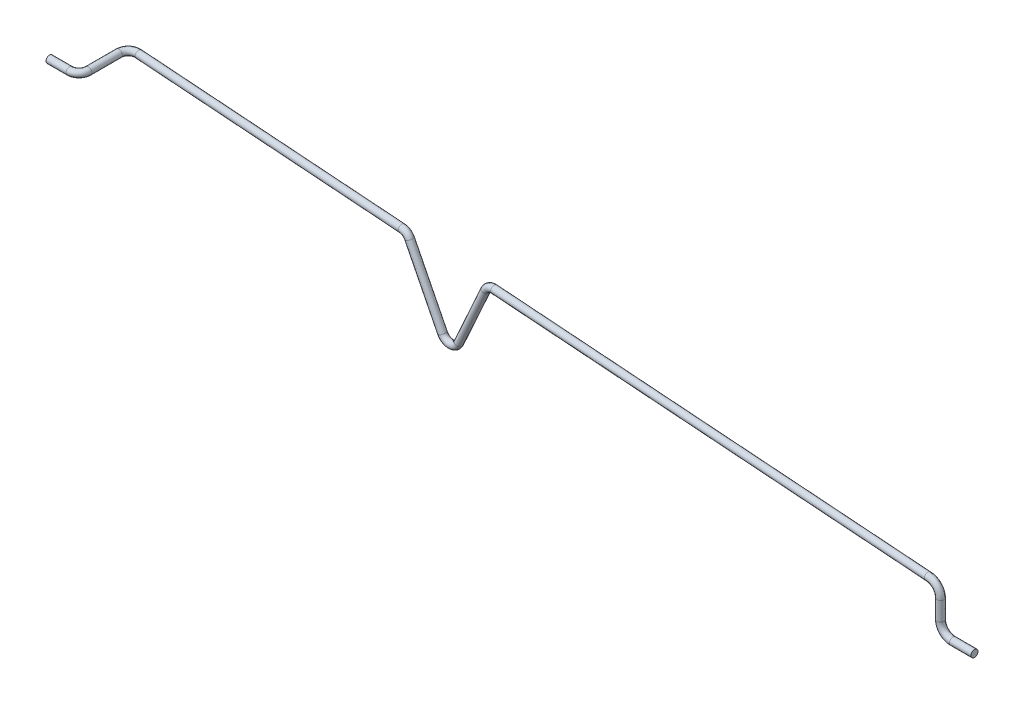
ISO-10303-21;
HEADER;
FILE_DESCRIPTION(('STEP AP214'),'2;1');
FILE_NAME('part.step','',(''),(''),'','','');
FILE_SCHEMA(('AUTOMOTIVE_DESIGN { 1 0 10303 214 1 1 1 1 }'));
ENDSEC;
DATA;
#1=APPLICATION_CONTEXT('core data for automotive mechanical design processes');
#2=APPLICATION_PROTOCOL_DEFINITION('international standard','automotive_design',2000,#1);
#3=PRODUCT_CONTEXT('',#1,'mechanical');
#4=PRODUCT('Part','Part','',(#3));
#5=PRODUCT_RELATED_PRODUCT_CATEGORY('part','',(#4));
#6=PRODUCT_DEFINITION_FORMATION('','',#4);
#7=PRODUCT_DEFINITION_CONTEXT('part definition',#1,'design');
#8=PRODUCT_DEFINITION('design','',#6,#7);
#9=PRODUCT_DEFINITION_SHAPE('','',#8);
#10=(LENGTH_UNIT() NAMED_UNIT(*) SI_UNIT(.MILLI.,.METRE.));
#11=(NAMED_UNIT(*) PLANE_ANGLE_UNIT() SI_UNIT($,.RADIAN.));
#12=(NAMED_UNIT(*) SI_UNIT($,.STERADIAN.) SOLID_ANGLE_UNIT());
#13=UNCERTAINTY_MEASURE_WITH_UNIT(LENGTH_MEASURE(1.E-05),#10,'distance_accuracy_value','');
#14=(GEOMETRIC_REPRESENTATION_CONTEXT(3) GLOBAL_UNCERTAINTY_ASSIGNED_CONTEXT((#13)) GLOBAL_UNIT_ASSIGNED_CONTEXT((#10,
#11,#12)) REPRESENTATION_CONTEXT('',''));
#15=CARTESIAN_POINT('',(0.,0.,0.));
#16=DIRECTION('',(0.,0.,1.));
#17=DIRECTION('',(1.,0.,0.));
#18=AXIS2_PLACEMENT_3D('',#15,#16,#17);
#19=CARTESIAN_POINT('',(-64.2188495074616,22.8960481279428,15.8483363673903));
#20=DIRECTION('',(1.,0.,0.));
#21=DIRECTION('',(0.,0.,-1.));
#22=AXIS2_PLACEMENT_3D('',#19,#20,#21);
#23=PLANE('',#22);
#24=CARTESIAN_POINT('',(-64.2188495074616,22.8960481279428,15.8483363673903));
#25=DIRECTION('',(1.,0.,0.));
#26=DIRECTION('',(0.,0.,-1.));
#27=AXIS2_PLACEMENT_3D('',#24,#25,#26);
#28=CIRCLE('',#27,0.375000000000001);
#29=CARTESIAN_POINT('',(-64.2188495074616,22.8960481279428,15.4733363673903));
#30=VERTEX_POINT('',#29);
#31=EDGE_CURVE('E233',#30,#30,#28,.T.);
#32=ORIENTED_EDGE('',*,*,#31,.F.);
#33=EDGE_LOOP('',(#32));
#34=FACE_BOUND('',#33,.T.);
#35=ADVANCED_FACE('F30',(#34),#23,.F.);
#36=CARTESIAN_POINT('',(31.4149506491111,14.4905385881416,13.));
#37=DIRECTION('',(1.,0.,0.));
#38=DIRECTION('',(0.,0.00337516126734805,-0.999994304126988));
#39=AXIS2_PLACEMENT_3D('',#36,#37,#38);
#40=PLANE('',#39);
#41=CARTESIAN_POINT('',(31.4149506491111,14.4905385881416,13.));
#42=DIRECTION('',(1.,0.,0.));
#43=DIRECTION('',(0.,0.00337516126734805,-0.999994304126988));
#44=AXIS2_PLACEMENT_3D('',#41,#42,#43);
#45=CIRCLE('',#44,0.375000000000001);
#46=CARTESIAN_POINT('',(31.4149506491111,14.4918042736168,12.6250021359524));
#47=VERTEX_POINT('',#46);
#48=EDGE_CURVE('E10',#47,#47,#45,.T.);
#49=ORIENTED_EDGE('',*,*,#48,.T.);
#50=EDGE_LOOP('',(#49));
#51=FACE_BOUND('',#50,.T.);
#52=ADVANCED_FACE('F127',(#51),#40,.T.);
#53=CARTESIAN_POINT('',(-59.66685028374,22.8959019788377,10.285494709423));
#54=CARTESIAN_POINT('',(-59.7419632939482,22.8959081179173,10.2735671038188));
#55=CARTESIAN_POINT('',(-59.7861856713361,22.8959117322668,10.2665215878197));
#56=CARTESIAN_POINT('',(-59.9491788533054,22.895925053902,10.2406873776312));
#57=CARTESIAN_POINT('',(-60.0620729197661,22.8959342808739,10.2336669901577));
#58=CARTESIAN_POINT('',(-60.2598447638031,22.895950445012,10.2453293695001));
#59=CARTESIAN_POINT('',(-60.3580820421677,22.8959584740666,10.2618879061166));
#60=CARTESIAN_POINT('',(-60.6439786449227,22.8959818407504,10.3425501113274));
#61=CARTESIAN_POINT('',(-60.8221902372007,22.8959964062049,10.4377969517152));
#62=CARTESIAN_POINT('',(-61.2740156605615,22.8960333344571,10.8235356976156));
#63=CARTESIAN_POINT('',(-61.45501726574,22.8960481279428,11.2145956624061));
#64=CARTESIAN_POINT('',(-61.45501726574,22.8960481279428,11.6121137336988));
#65=CARTESIAN_POINT('',(-59.6668317190504,23.0922515181698,10.2854788601156));
#66=CARTESIAN_POINT('',(-59.7419451260393,23.0922576572818,10.2735511915044));
#67=CARTESIAN_POINT('',(-59.7861665783051,23.0922612715557,10.2665058221397));
#68=CARTESIAN_POINT('',(-59.9491608616475,23.0922745932809,10.2406714376226));
#69=CARTESIAN_POINT('',(-60.0620566624428,23.0922838203945,10.2336509020387));
#70=CARTESIAN_POINT('',(-60.2598308147132,23.0922999847213,10.245313417495));
#71=CARTESIAN_POINT('',(-60.3580692396241,23.0923080138696,10.2618721473694));
#72=CARTESIAN_POINT('',(-60.643969179134,23.0923313808262,10.3425352940042));
#73=CARTESIAN_POINT('',(-60.822182851354,23.0923459464508,10.4377832460359));
#74=CARTESIAN_POINT('',(-61.2740135480564,23.0923828751335,10.8235264939696));
#75=CARTESIAN_POINT('',(-61.45501726574,23.0923976687921,11.2145910228949));
#76=CARTESIAN_POINT('',(-61.45501726574,23.0923976687921,11.6121137336988));
#77=CARTESIAN_POINT('',(-59.6948326599645,23.2709188671956,10.4619041950578));
#78=CARTESIAN_POINT('',(-59.765529332498,23.2709246453224,10.4506778838612));
#79=CARTESIAN_POINT('',(-59.8200487142283,23.270929101259,10.4420002644178));
#80=CARTESIAN_POINT('',(-59.9707831417774,23.2709414209707,10.4181064055597));
#81=CARTESIAN_POINT('',(-60.0643733360512,23.2709490702133,10.4127345499684));
#82=CARTESIAN_POINT('',(-60.2364535661927,23.270963134544,10.4228819242368));
#83=CARTESIAN_POINT('',(-60.3219292998683,23.2709701205817,10.4372894189219));
#84=CARTESIAN_POINT('',(-60.5706864140982,23.2709904518091,10.5074731748749));
#85=CARTESIAN_POINT('',(-60.7257473731661,23.2710031251335,10.5903469443642));
#86=CARTESIAN_POINT('',(-61.1188782721293,23.2710352562097,10.9259761765848));
#87=CARTESIAN_POINT('',(-61.2763668065893,23.2710481279428,11.2662353730734));
#88=CARTESIAN_POINT('',(-61.2763668065893,23.2710481279428,11.6121137336988));
#89=CARTESIAN_POINT('',(-59.756419834252,23.2709559965747,10.8497438363423));
#90=CARTESIAN_POINT('',(-59.817407103612,23.2709609811399,10.8400593343661));
#91=CARTESIAN_POINT('',(-59.8945646470963,23.2709672873216,10.8277935041633));
#92=CARTESIAN_POINT('',(-60.0183479676792,23.2709774042859,10.8081655449608));
#93=CARTESIAN_POINT('',(-60.0694982283107,23.2709815848601,10.8064180183642));
#94=CARTESIAN_POINT('',(-60.1850949520155,23.2709910327237,10.8132346248894));
#95=CARTESIAN_POINT('',(-60.2425141846665,23.2709957256688,10.8229130125867));
#96=CARTESIAN_POINT('',(-60.4096194202858,23.2710093833869,10.8700596966589));
#97=CARTESIAN_POINT('',(-60.5137832677416,23.2710178968272,10.92573103221));
#98=CARTESIAN_POINT('',(-60.7778731278621,23.2710394812195,11.1511935364873));
#99=CARTESIAN_POINT('',(-60.8836677248906,23.2710481279428,11.379766268474));
#100=CARTESIAN_POINT('',(-60.8836677248906,23.2710481279428,11.6121137336988));
#101=CARTESIAN_POINT('',(-59.7844545576776,23.0923224300603,11.0261980125646));
#102=CARTESIAN_POINT('',(-59.8410243705521,23.0923270535814,11.017214982658));
#103=CARTESIAN_POINT('',(-59.9284815269653,23.0923342015631,11.0033166355428));
#104=CARTESIAN_POINT('',(-60.0400029875627,23.0923433163506,10.9856295192288));
#105=CARTESIAN_POINT('',(-60.0718444856738,23.0923459187954,10.9855309421438));
#106=CARTESIAN_POINT('',(-60.1617430869135,23.0923532663199,10.9908321597924));
#107=CARTESIAN_POINT('',(-60.2063975419373,23.0923569159838,10.9983589606251));
#108=CARTESIAN_POINT('',(-60.3363538803235,23.0923675374764,11.0350245408887));
#109=CARTESIAN_POINT('',(-60.4173612297189,23.0923741583076,11.0783196710169));
#110=CARTESIAN_POINT('',(-60.6227416960955,23.0923909443078,11.2536599671513));
#111=CARTESIAN_POINT('',(-60.70501726574,23.0923976687921,11.4314190612556));
#112=CARTESIAN_POINT('',(-60.70501726574,23.0923976687921,11.6121137336988));
#113=CARTESIAN_POINT('',(-59.7844916870567,22.6996233513963,11.0262297111795));
#114=CARTESIAN_POINT('',(-59.8410607063701,22.6996279748524,11.0172468072868));
#115=CARTESIAN_POINT('',(-59.9285197130273,22.6996351229853,11.0033481669027));
#116=CARTESIAN_POINT('',(-60.0400389708783,22.6996442375928,10.985661399246));
#117=CARTESIAN_POINT('',(-60.0718770003203,22.6996468397542,10.985563118382));
#118=CARTESIAN_POINT('',(-60.1617709850934,22.6996541869013,10.9908640638026));
#119=CARTESIAN_POINT('',(-60.2064231470246,22.6996578363779,10.9983904781197));
#120=CARTESIAN_POINT('',(-60.336372811901,22.6996684573247,11.0350541755346));
#121=CARTESIAN_POINT('',(-60.4173760014123,22.6996750778159,11.0783470823748));
#122=CARTESIAN_POINT('',(-60.6227459211057,22.6996918629549,11.2536783744445));
#123=CARTESIAN_POINT('',(-60.70501726574,22.6996985870934,11.4314283402772));
#124=CARTESIAN_POINT('',(-60.70501726574,22.6996985870934,11.6121137336988));
#125=CARTESIAN_POINT('',(-59.7564907461426,22.5209560023704,10.8498043762373));
#126=CARTESIAN_POINT('',(-59.8174764999117,22.5209609868118,10.84012011493));
#127=CARTESIAN_POINT('',(-59.8946375771036,22.5209672932821,10.8278537246248));
#128=CARTESIAN_POINT('',(-60.018416690749,22.5209774099029,10.8082264313087));
#129=CARTESIAN_POINT('',(-60.0695603267119,22.5209815899356,10.8064794704524));
#130=CARTESIAN_POINT('',(-60.1851482336138,22.5209910370784,10.8132955570607));
#131=CARTESIAN_POINT('',(-60.2425630867806,22.5209957296658,10.822973206567));
#132=CARTESIAN_POINT('',(-60.4096555769362,22.5210093863418,10.8701162946643));
#133=CARTESIAN_POINT('',(-60.5138114795997,22.5210178991331,10.925783384047));
#134=CARTESIAN_POINT('',(-60.7778811970338,22.5210394818787,11.1512286918282));
#135=CARTESIAN_POINT('',(-60.8836677248906,22.5210481279428,11.3797839900994));
#136=CARTESIAN_POINT('',(-60.8836677248906,22.5210481279428,11.6121137336988));
#137=CARTESIAN_POINT('',(-59.6949035718551,22.5209188729913,10.4619647349527));
#138=CARTESIAN_POINT('',(-59.7655987287977,22.5209246509943,10.4507386644251));
#139=CARTESIAN_POINT('',(-59.8201216442356,22.5209291072195,10.4420604848793));
#140=CARTESIAN_POINT('',(-59.9708518648472,22.5209414265877,10.4181672919076));
#141=CARTESIAN_POINT('',(-60.0644354344523,22.5209490752888,10.4127960020566));
#142=CARTESIAN_POINT('',(-60.2365068477911,22.5209631388987,10.4229428564081));
#143=CARTESIAN_POINT('',(-60.3219782019824,22.5209701245786,10.4373496129025));
#144=CARTESIAN_POINT('',(-60.5707225707487,22.520990454764,10.5075297728799));
#145=CARTESIAN_POINT('',(-60.7257755850231,22.5210031274395,10.5903992962007));
#146=CARTESIAN_POINT('',(-61.118886341303,22.5210352568689,10.9260113319267));
#147=CARTESIAN_POINT('',(-61.2763668065893,22.5210481279428,11.2662530946981));
#148=CARTESIAN_POINT('',(-61.2763668065893,22.5210481279428,11.6121137336988));
#149=CARTESIAN_POINT('',(-59.6668688484295,22.6995524395057,10.2855105587304));
#150=CARTESIAN_POINT('',(-59.7419814618572,22.6995585785528,10.2735830161332));
#151=CARTESIAN_POINT('',(-59.7862047643672,22.6995621929779,10.2665373534997));
#152=CARTESIAN_POINT('',(-59.9491968449632,22.6995755145231,10.2407033176398));
#153=CARTESIAN_POINT('',(-60.0620891770893,22.6995847413533,10.2336830782768));
#154=CARTESIAN_POINT('',(-60.2598587128931,22.6996009053027,10.2453453215053));
#155=CARTESIAN_POINT('',(-60.3580948447114,22.6996089342637,10.2619036648638));
#156=CARTESIAN_POINT('',(-60.6439881107115,22.6996323006746,10.3425649286506));
#157=CARTESIAN_POINT('',(-60.8221976230474,22.6996468659591,10.4378106573944));
#158=CARTESIAN_POINT('',(-61.2740177730667,22.6996837937806,10.8235449012617));
#159=CARTESIAN_POINT('',(-61.45501726574,22.6996985870934,11.2146003019172));
#160=CARTESIAN_POINT('',(-61.45501726574,22.6996985870934,11.6121137336988));
#161=CARTESIAN_POINT('',(-59.66685028374,22.8959019788377,10.285494709423));
#162=CARTESIAN_POINT('',(-59.7419632939482,22.8959081179173,10.2735671038188));
#163=CARTESIAN_POINT('',(-59.7861856713361,22.8959117322668,10.2665215878197));
#164=CARTESIAN_POINT('',(-59.9491788533054,22.895925053902,10.2406873776312));
#165=CARTESIAN_POINT('',(-60.0620729197661,22.8959342808739,10.2336669901577));
#166=CARTESIAN_POINT('',(-60.2598447638031,22.895950445012,10.2453293695001));
#167=CARTESIAN_POINT('',(-60.3580820421677,22.8959584740666,10.2618879061166));
#168=CARTESIAN_POINT('',(-60.6439786449227,22.8959818407504,10.3425501113274));
#169=CARTESIAN_POINT('',(-60.8221902372007,22.8959964062049,10.4377969517152));
#170=CARTESIAN_POINT('',(-61.2740156605615,22.8960333344571,10.8235356976156));
#171=CARTESIAN_POINT('',(-61.45501726574,22.8960481279428,11.2145956624061));
#172=CARTESIAN_POINT('',(-61.45501726574,22.8960481279428,11.6121137336988));
#173=B_SPLINE_SURFACE_WITH_KNOTS('',3,3,((#53,#54,#55,#56,#57,#58,#59,#60,#61,#62,#63,#64),(#65,
#66,#67,#68,#69,#70,#71,#72,#73,#74,#75,#76),(#77,#78,#79,#80,#81,#82,#83,#84,#85,#86,#87,#88),
(#89,#90,#91,#92,#93,#94,#95,#96,#97,#98,#99,#100),(#101,#102,#103,#104,#105,#106,#107,#108,
#109,#110,#111,#112),(#113,#114,#115,#116,#117,#118,#119,#120,#121,#122,#123,#124),(#125,#126,
#127,#128,#129,#130,#131,#132,#133,#134,#135,#136),(#137,#138,#139,#140,#141,#142,#143,#144,
#145,#146,#147,#148),(#149,#150,#151,#152,#153,#154,#155,#156,#157,#158,#159,#160),(#161,#162,
#163,#164,#165,#166,#167,#168,#169,#170,#171,#172)),.UNSPECIFIED.,.T.,.F.,.F.,(4,2,2,2,4),(4,2,
2,2,2,4),(0.,0.25,0.5,0.75,1.),(-0.0229632619529378,0.,0.0249056285781138,0.0498112571562277,
0.0996225143124553,0.199245028624911),.UNSPECIFIED.);
#174=CARTESIAN_POINT('',(-59.9231868103733,22.895953578755,10.6244881938014));
#175=DIRECTION('',(-0.995488107498007,0.0217371518266946,-0.0923630015780107));
#176=DIRECTION('',(-0.0808192973258083,0.315774535423993,0.945385997335228));
#177=AXIS2_PLACEMENT_3D('',#174,#175,#176);
#178=ELLIPSE('',#177,0.375880853129422,0.375000000000001);
#179=CARTESIAN_POINT('',(-59.9535652368014,23.0146471805267,10.9798406890164));
#180=VERTEX_POINT('',#179);
#181=EDGE_CURVE('E33',#180,#180,#178,.T.);
#182=CARTESIAN_POINT('',(-61.08001726574,22.8960481279428,11.6121137336988));
#183=DIRECTION('',(0.,0.,-1.));
#184=DIRECTION('',(-1.,0.,0.));
#185=AXIS2_PLACEMENT_3D('',#182,#183,#184);
#186=CIRCLE('',#185,0.375000000000001);
#187=CARTESIAN_POINT('',(-61.45501726574,22.8960481279428,11.6121137336988));
#188=VERTEX_POINT('',#187);
#189=EDGE_CURVE('E224',#188,#188,#186,.T.);
#190=ORIENTED_EDGE('',*,*,#181,.T.);
#191=EDGE_LOOP('',(#190));
#192=FACE_BOUND('',#191,.T.);
#193=ORIENTED_EDGE('',*,*,#189,.T.);
#194=EDGE_LOOP('',(#193));
#195=FACE_BOUND('',#194,.T.);
#196=ADVANCED_FACE('F120',(#192,#195),#173,.F.);
#197=CARTESIAN_POINT('',(-61.08001726574,22.8960481279428,11.6121137336988));
#198=DIRECTION('',(0.,0.,1.));
#199=DIRECTION('',(1.,0.,0.));
#200=AXIS2_PLACEMENT_3D('',#197,#198,#199);
#201=CYLINDRICAL_SURFACE('',#200,0.375000000000001);
#202=CARTESIAN_POINT('',(-61.08001726574,22.8960481279428,14.8483363673903));
#203=DIRECTION('',(0.,0.,-1.));
#204=DIRECTION('',(-1.,0.,0.));
#205=AXIS2_PLACEMENT_3D('',#202,#203,#204);
#206=CIRCLE('',#205,0.375000000000001);
#207=CARTESIAN_POINT('',(-60.70501726574,22.8960481279428,14.8483363673903));
#208=VERTEX_POINT('',#207);
#209=EDGE_CURVE('E226',#208,#208,#206,.T.);
#210=ORIENTED_EDGE('',*,*,#209,.T.);
#211=EDGE_LOOP('',(#210));
#212=FACE_BOUND('',#211,.T.);
#213=ORIENTED_EDGE('',*,*,#189,.F.);
#214=EDGE_LOOP('',(#213));
#215=FACE_BOUND('',#214,.T.);
#216=ADVANCED_FACE('F109',(#212,#215),#201,.T.);
#217=CARTESIAN_POINT('',(-62.08001726574,22.8960481279428,14.8483363673903));
#218=DIRECTION('',(0.,-1.,0.));
#219=DIRECTION('',(0.,0.,-1.));
#220=AXIS2_PLACEMENT_3D('',#217,#218,#219);
#221=TOROIDAL_SURFACE('',#220,1.00000000000001,0.375000000000001);
#222=CARTESIAN_POINT('',(-62.08001726574,22.8960481279428,15.8483363673903));
#223=DIRECTION('',(1.,0.,0.));
#224=DIRECTION('',(0.,0.,-1.));
#225=AXIS2_PLACEMENT_3D('',#222,#223,#224);
#226=CIRCLE('',#225,0.375000000000001);
#227=CARTESIAN_POINT('',(-62.08001726574,22.8960481279428,16.2233363673903));
#228=VERTEX_POINT('',#227);
#229=EDGE_CURVE('E230',#228,#228,#226,.T.);
#230=CARTESIAN_POINT('',(-62.08001726574,22.8960481279428,14.8483363673903));
#231=DIRECTION('',(0.,-1.,0.));
#232=DIRECTION('',(0.,0.,-1.));
#233=AXIS2_PLACEMENT_3D('',#230,#231,#232);
#234=CIRCLE('',#233,1.37500000000001);
#235=EDGE_CURVE('',#208,#228,#234,.T.);
#236=ORIENTED_EDGE('',*,*,#209,.F.);
#237=ORIENTED_EDGE('',*,*,#229,.T.);
#238=ORIENTED_EDGE('',*,*,#235,.T.);
#239=ORIENTED_EDGE('',*,*,#235,.F.);
#240=EDGE_LOOP('',(#236,#238,#237,#239));
#241=FACE_BOUND('',#240,.T.);
#242=ADVANCED_FACE('F119',(#241),#221,.T.);
#243=CARTESIAN_POINT('',(-62.08001726574,22.8960481279428,15.8483363673903));
#244=DIRECTION('',(-1.,0.,0.));
#245=DIRECTION('',(0.,0.,1.));
#246=AXIS2_PLACEMENT_3D('',#243,#244,#245);
#247=CYLINDRICAL_SURFACE('',#246,0.375000000000001);
#248=ORIENTED_EDGE('',*,*,#31,.T.);
#249=EDGE_LOOP('',(#248));
#250=FACE_BOUND('',#249,.T.);
#251=ORIENTED_EDGE('',*,*,#229,.F.);
#252=EDGE_LOOP('',(#251));
#253=FACE_BOUND('',#252,.T.);
#254=ADVANCED_FACE('F88',(#250,#253),#247,.T.);
#255=CARTESIAN_POINT('',(26.6556677747406,19.1428719036104,13.0053038780196));
#256=DIRECTION('',(-0.998684950906861,0.0432917044981977,-0.027462650159852));
#257=DIRECTION('',(-0.0433080389785005,-0.999061766739092,0.));
#258=AXIS2_PLACEMENT_3D('',#255,#256,#257);
#259=CYLINDRICAL_SURFACE('',#258,0.375000000000001);
#260=CARTESIAN_POINT('',(26.4611326516824,19.152765244194,12.624814038488));
#261=CARTESIAN_POINT('',(26.4607691836794,19.1330148023952,12.6247497812131));
#262=CARTESIAN_POINT('',(26.4603805356909,19.1132608442629,12.626504011793));
#263=CARTESIAN_POINT('',(26.4595669916344,19.0743274861774,12.6334045187162));
#264=CARTESIAN_POINT('',(26.4591420184419,19.0551494316947,12.6385581765406));
#265=CARTESIAN_POINT('',(26.4582728467392,19.0179883676209,12.6518537983054));
#266=CARTESIAN_POINT('',(26.4578287703566,18.9999992207451,12.6599787216062));
#267=CARTESIAN_POINT('',(26.4569317301739,18.9654742875904,12.6788133911895));
#268=CARTESIAN_POINT('',(26.4564787681213,18.9489382189655,12.689522633794));
#269=CARTESIAN_POINT('',(26.4550211473983,18.8984775829741,12.7276607176761));
#270=CARTESIAN_POINT('',(26.4540129111647,18.8677563683137,12.759627459868));
#271=CARTESIAN_POINT('',(26.4525526837515,18.8297274947308,12.8145599529353));
#272=CARTESIAN_POINT('',(26.4520607410307,18.8181847013693,12.8347613782733));
#273=CARTESIAN_POINT('',(26.4511234819598,18.7989687173499,12.8769569987221));
#274=CARTESIAN_POINT('',(26.4506781111512,18.7912909661073,12.8989490451943));
#275=CARTESIAN_POINT('',(26.4498881313585,18.7808752574254,12.9422356731663));
#276=CARTESIAN_POINT('',(26.449538325614,18.7777929811835,12.9634466096379));
#277=CARTESIAN_POINT('',(26.4489140791441,18.7758528664935,13.0060543679817));
#278=CARTESIAN_POINT('',(26.4486395715797,18.7769912683964,13.0274510074906));
#279=CARTESIAN_POINT('',(26.4482023496195,18.7829000745747,13.0670012085214));
#280=CARTESIAN_POINT('',(26.4480299887026,18.7872021587518,13.0852276807053));
#281=CARTESIAN_POINT('',(26.4477483760824,18.7985589457747,13.1207879300875));
#282=CARTESIAN_POINT('',(26.447639166309,18.805615472264,13.1381211072343));
#283=CARTESIAN_POINT('',(26.4473921432408,18.8317714290636,13.1909447840266));
#284=CARTESIAN_POINT('',(26.4473664933114,18.8553760986522,13.2243318233828));
#285=CARTESIAN_POINT('',(26.447536000939,18.8987087775704,13.2699398603377));
#286=CARTESIAN_POINT('',(26.4476393770768,18.9156073217927,13.2850269484565));
#287=CARTESIAN_POINT('',(26.4479294332928,18.9517050121617,13.3122424288723));
#288=CARTESIAN_POINT('',(26.448116179385,18.9709059725787,13.3243684647544));
#289=CARTESIAN_POINT('',(26.4485748750963,19.0113638979059,13.3451975791983));
#290=CARTESIAN_POINT('',(26.4488477564891,19.0326414999516,13.3538607576084));
#291=CARTESIAN_POINT('',(26.449475087118,19.0764536854633,13.3669601114042));
#292=CARTESIAN_POINT('',(26.4498293993908,19.0989861106861,13.3714033209125));
#293=CARTESIAN_POINT('',(26.450565297101,19.1417770024293,13.3752775664378));
#294=CARTESIAN_POINT('',(26.4509386353234,19.1619874228505,13.3752415738531));
#295=CARTESIAN_POINT('',(26.4517297959981,19.2020621904103,13.371486392923));
#296=CARTESIAN_POINT('',(26.4521476374202,19.2219263857375,13.367765628278));
#297=CARTESIAN_POINT('',(26.4529821048118,19.2593920525525,13.3573896823117));
#298=CARTESIAN_POINT('',(26.4533968473082,19.2770552625955,13.3509533429433));
#299=CARTESIAN_POINT('',(26.4542396970355,19.3112184163353,13.3355591481779));
#300=CARTESIAN_POINT('',(26.4546678066151,19.327718153914,13.3266008473922));
#301=CARTESIAN_POINT('',(26.4560705114827,19.3791745961469,13.2937691504496));
#302=CARTESIAN_POINT('',(26.4570578988224,19.4113610313541,13.2652691570633));
#303=CARTESIAN_POINT('',(26.4585245991298,19.4531936346731,13.2149488012459));
#304=CARTESIAN_POINT('',(26.4590314556965,19.4664457119685,13.1959506904479));
#305=CARTESIAN_POINT('',(26.4600089618796,19.4894415853906,13.155889902934));
#306=CARTESIAN_POINT('',(26.4604796196366,19.4991861721116,13.1348276928331));
#307=CARTESIAN_POINT('',(26.4613456144605,19.5141920879575,13.0921684601659));
#308=CARTESIAN_POINT('',(26.4617433211896,19.5196282964833,13.0706334539364));
#309=CARTESIAN_POINT('',(26.4624673267403,19.5261532638337,13.026926724413));
#310=CARTESIAN_POINT('',(26.4627937524446,19.5272498079973,13.0047562132776));
#311=CARTESIAN_POINT('',(26.4633210683673,19.5250885346828,12.9636884086415));
#312=CARTESIAN_POINT('',(26.4635330271129,19.5224063301488,12.9447585584884));
#313=CARTESIAN_POINT('',(26.4638912866307,19.513991110222,12.9075777901196));
#314=CARTESIAN_POINT('',(26.4640374525191,19.5082518796142,12.8893283363809));
#315=CARTESIAN_POINT('',(26.4643817922188,19.4866397559041,12.8355277449585));
#316=CARTESIAN_POINT('',(26.4644771831989,19.4664267698536,12.8016214530489));
#317=CARTESIAN_POINT('',(26.4644269568177,19.4281485176355,12.754128152221));
#318=CARTESIAN_POINT('',(26.464367635101,19.4129259545166,12.7380899388836));
#319=CARTESIAN_POINT('',(26.4641691261612,19.380085485446,12.7085966947131));
#320=CARTESIAN_POINT('',(26.4640298469623,19.3624648387945,12.695144662619));
#321=CARTESIAN_POINT('',(26.4636633480013,19.3243366640788,12.6707518938343));
#322=CARTESIAN_POINT('',(26.4634321931799,19.3037306090286,12.6599644725216));
#323=CARTESIAN_POINT('',(26.4628847551225,19.2609172882656,12.6424146374638));
#324=CARTESIAN_POINT('',(26.4625687274964,19.2387149746478,12.635640330743));
#325=CARTESIAN_POINT('',(26.4618848802988,19.1952170600356,12.6270529076298));
#326=CARTESIAN_POINT('',(26.4615233101126,19.1739931831717,12.6248831027411));
#327=CARTESIAN_POINT('',(26.4611326516824,19.152765244194,12.624814038488));
#328=B_SPLINE_CURVE_WITH_KNOTS('',3,(#260,#261,#262,#263,#264,#265,#266,#267,#268,#269,#270,
#271,#272,#273,#274,#275,#276,#277,#278,#279,#280,#281,#282,#283,#284,#285,#286,#287,#288,#289,
#290,#291,#292,#293,#294,#295,#296,#297,#298,#299,#300,#301,#302,#303,#304,#305,#306,#307,#308,
#309,#310,#311,#312,#313,#314,#315,#316,#317,#318,#319,#320,#321,#322,#323,#324,#325,#326,#327),
.UNSPECIFIED.,.T.,.F.,(4,2,2,2,2,2,2,2,2,2,2,2,2,2,2,2,2,2,2,2,2,2,2,2,2,2,2,2,2,2,2,2,2,4),(0.,
0.05918459036512,0.118498118465079,0.177476677140948,0.236443750301533,0.36684682644776,
0.436375472166972,0.50582188361996,0.569744868280976,0.633610926019884,0.68955028758337,
0.745526748110397,0.866033728001825,0.933765622540419,1.00155124394909,1.07009683377417,
1.13852796572137,1.19882542892012,1.25914869777079,1.315333244057,1.37152771899149,
1.49811450420513,1.56735966269204,1.63658920341442,1.70283965041427,1.7689711903798,
1.82604847692585,1.88324225226625,1.99963945470717,2.06576606492012,2.13196889408505,
2.20138039184734,2.27058514411813,2.33419723368511),.UNSPECIFIED.);
#329=CARTESIAN_POINT('',(26.461132651683,19.152765244194,12.624814038488));
#330=VERTEX_POINT('',#329);
#331=EDGE_CURVE('E65',#330,#330,#328,.T.);
#332=ORIENTED_EDGE('',*,*,#331,.T.);
#333=EDGE_LOOP('',(#332));
#334=FACE_BOUND('',#333,.T.);
#335=CARTESIAN_POINT('',(-21.026499778463,21.2098323656384,11.6941008953492));
#336=DIRECTION('',(0.998684950906861,-0.0432917044981977,0.027462650159852));
#337=DIRECTION('',(0.0276064476766096,0.00272714377870501,-0.999615149311718));
#338=AXIS2_PLACEMENT_3D('',#335,#336,#337);
#339=CIRCLE('',#338,0.375000000000001);
#340=CARTESIAN_POINT('',(-21.0104190881783,21.5844432454198,11.6998541682792));
#341=VERTEX_POINT('',#340);
#342=EDGE_CURVE('E47',#341,#341,#339,.T.);
#343=ORIENTED_EDGE('',*,*,#342,.T.);
#344=EDGE_LOOP('',(#343));
#345=FACE_BOUND('',#344,.T.);
#346=ADVANCED_FACE('F83',(#334,#345),#259,.T.);
#347=CARTESIAN_POINT('',(-21.0693816192223,20.2108700195548,11.6787588342026));
#348=DIRECTION('',(-0.0280983374109124,-0.014144236592073,0.999505089534801));
#349=DIRECTION('',(0.999605084747423,0.,0.0281011485013743));
#350=AXIS2_PLACEMENT_3D('',#347,#348,#349);
#351=TOROIDAL_SURFACE('',#350,1.,0.375000000000001);
#352=CARTESIAN_POINT('',(-21.9748546219661,20.6348277183897,11.6593034775928));
#353=DIRECTION('',(0.423472696566027,0.905571537853241,0.0247197308483585));
#354=DIRECTION('',(0.0384442729111264,0.00929831270203577,-0.999217483464551));
#355=AXIS2_PLACEMENT_3D('',#352,#353,#354);
#356=CIRCLE('',#355,0.375000000000001);
#357=CARTESIAN_POINT('',(-22.314406997995,20.7938118554527,11.6520077188641));
#358=VERTEX_POINT('',#357);
#359=EDGE_CURVE('E50',#358,#358,#356,.T.);
#360=CARTESIAN_POINT('',(-21.0693816192223,20.2108700195548,11.6787588342026));
#361=DIRECTION('',(-0.0280983374109124,-0.014144236592073,0.999505089534801));
#362=DIRECTION('',(0.999605084747423,0.,0.0281011485013743));
#363=AXIS2_PLACEMENT_3D('',#360,#361,#362);
#364=CIRCLE('',#363,1.375);
#365=EDGE_CURVE('',#341,#358,#364,.T.);
#366=ORIENTED_EDGE('',*,*,#342,.F.);
#367=ORIENTED_EDGE('',*,*,#359,.T.);
#368=ORIENTED_EDGE('',*,*,#365,.T.);
#369=ORIENTED_EDGE('',*,*,#365,.F.);
#370=EDGE_LOOP('',(#366,#368,#367,#369));
#371=FACE_BOUND('',#370,.T.);
#372=ADVANCED_FACE('F87',(#371),#351,.T.);
#373=CARTESIAN_POINT('',(-21.9748546219661,20.6348277183897,11.6593034775928));
#374=DIRECTION('',(-0.423472696566024,-0.905571537853241,-0.0247197308483568));
#375=DIRECTION('',(0.905848346298783,-0.423602140584488,0.));
#376=AXIS2_PLACEMENT_3D('',#373,#374,#375);
#377=CYLINDRICAL_SURFACE('',#376,0.375000000000001);
#378=CARTESIAN_POINT('',(-24.9942013941655,14.178131638607,11.4830525878616));
#379=DIRECTION('',(0.423472696566025,0.905571537853242,0.0247197308483568));
#380=DIRECTION('',(0.0384442729111257,0.0092983127020343,-0.999217483464551));
#381=AXIS2_PLACEMENT_3D('',#378,#379,#380);
#382=CIRCLE('',#381,0.375000000000001);
#383=CARTESIAN_POINT('',(-24.6546490181366,14.019147501544,11.4903483465903));
#384=VERTEX_POINT('',#383);
#385=EDGE_CURVE('E53',#384,#384,#382,.T.);
#386=ORIENTED_EDGE('',*,*,#385,.T.);
#387=EDGE_LOOP('',(#386));
#388=FACE_BOUND('',#387,.T.);
#389=ORIENTED_EDGE('',*,*,#359,.F.);
#390=EDGE_LOOP('',(#389));
#391=FACE_BOUND('',#390,.T.);
#392=ADVANCED_FACE('F193',(#388,#391),#377,.T.);
#393=CARTESIAN_POINT('',(-25.8996743969093,14.6020893374419,11.4635972312518));
#394=DIRECTION('',(0.0280983374109124,0.0141442365920712,-0.999505089534801));
#395=DIRECTION('',(-0.999605084747423,0.,-0.0281011485013743));
#396=AXIS2_PLACEMENT_3D('',#393,#394,#395);
#397=TOROIDAL_SURFACE('',#396,0.999999999999998,0.375000000000001);
#398=CARTESIAN_POINT('',(-26.7924474176492,14.1526822197359,11.4321397044254));
#399=DIRECTION('',(0.449629644122343,-0.893215082231831,-1.9541182720097E-13));
#400=DIRECTION('',(0.0178938678969091,0.00900747604322991,-0.999799317296736));
#401=AXIS2_PLACEMENT_3D('',#398,#399,#400);
#402=CIRCLE('',#401,0.375000000000001);
#403=CARTESIAN_POINT('',(-27.1272373004267,13.9841545505961,11.4203431318655));
#404=VERTEX_POINT('',#403);
#405=EDGE_CURVE('E56',#404,#404,#402,.T.);
#406=CARTESIAN_POINT('',(-25.8996743969093,14.6020893374419,11.4635972312518));
#407=DIRECTION('',(0.0280983374109124,0.0141442365920712,-0.999505089534801));
#408=DIRECTION('',(-0.999605084747423,0.,-0.0281011485013743));
#409=AXIS2_PLACEMENT_3D('',#406,#407,#408);
#410=CIRCLE('',#409,1.375);
#411=EDGE_CURVE('',#384,#404,#410,.T.);
#412=ORIENTED_EDGE('',*,*,#385,.F.);
#413=ORIENTED_EDGE('',*,*,#405,.T.);
#414=ORIENTED_EDGE('',*,*,#411,.T.);
#415=ORIENTED_EDGE('',*,*,#411,.F.);
#416=EDGE_LOOP('',(#412,#414,#413,#415));
#417=FACE_BOUND('',#416,.T.);
#418=ADVANCED_FACE('F198',(#417),#397,.T.);
#419=CARTESIAN_POINT('',(-26.7924474176492,14.1526822197359,11.4321397044254));
#420=DIRECTION('',(-0.449629644122344,0.893215082231829,1.94523058664612E-13));
#421=DIRECTION('',(-0.89321508223183,-0.449629644122344,0.));
#422=AXIS2_PLACEMENT_3D('',#419,#420,#421);
#423=CYLINDRICAL_SURFACE('',#422,0.375000000000001);
#424=CARTESIAN_POINT('',(-30.2889237075634,21.0986329541753,11.4321397044269));
#425=DIRECTION('',(0.449629644122344,-0.89321508223183,-1.94519302736331E-13));
#426=DIRECTION('',(0.0178938678969095,0.00900747604322914,-0.999799317296736));
#427=AXIS2_PLACEMENT_3D('',#424,#425,#426);
#428=CIRCLE('',#427,0.375000000000001);
#429=CARTESIAN_POINT('',(-29.9541338247859,21.2671606233151,11.4439362769868));
#430=VERTEX_POINT('',#429);
#431=EDGE_CURVE('E59',#430,#430,#428,.T.);
#432=ORIENTED_EDGE('',*,*,#431,.T.);
#433=EDGE_LOOP('',(#432));
#434=FACE_BOUND('',#433,.T.);
#435=ORIENTED_EDGE('',*,*,#405,.F.);
#436=EDGE_LOOP('',(#435));
#437=FACE_BOUND('',#436,.T.);
#438=ADVANCED_FACE('F205',(#434,#437),#423,.T.);
#439=CARTESIAN_POINT('',(-31.1816967283034,20.6492258364693,11.4006821776006));
#440=DIRECTION('',(-0.0280983374109124,-0.014144236592073,0.999505089534801));
#441=DIRECTION('',(0.999605084747424,0.,0.0281011485013742));
#442=AXIS2_PLACEMENT_3D('',#439,#440,#441);
#443=TOROIDAL_SURFACE('',#442,1.,0.375000000000001);
#444=CARTESIAN_POINT('',(-31.1388148875441,21.6481881825529,11.4160242387473));
#445=DIRECTION('',(0.99868495090686,-0.0432917044982054,0.0274626501598509));
#446=DIRECTION('',(0.0276064476766086,0.00272714377870502,-0.999615149311718));
#447=AXIS2_PLACEMENT_3D('',#444,#445,#446);
#448=CIRCLE('',#447,0.375000000000001);
#449=CARTESIAN_POINT('',(-31.1227341972593,22.0227990623343,11.4217775116772));
#450=VERTEX_POINT('',#449);
#451=EDGE_CURVE('E62',#450,#450,#448,.T.);
#452=CARTESIAN_POINT('',(-31.1816967283034,20.6492258364693,11.4006821776006));
#453=DIRECTION('',(-0.0280983374109124,-0.014144236592073,0.999505089534801));
#454=DIRECTION('',(0.999605084747424,0.,0.0281011485013742));
#455=AXIS2_PLACEMENT_3D('',#452,#453,#454);
#456=CIRCLE('',#455,1.375);
#457=EDGE_CURVE('',#430,#450,#456,.T.);
#458=ORIENTED_EDGE('',*,*,#431,.F.);
#459=ORIENTED_EDGE('',*,*,#451,.T.);
#460=ORIENTED_EDGE('',*,*,#457,.T.);
#461=ORIENTED_EDGE('',*,*,#457,.F.);
#462=EDGE_LOOP('',(#458,#460,#459,#461));
#463=FACE_BOUND('',#462,.T.);
#464=ADVANCED_FACE('F165',(#463),#443,.T.);
#465=CARTESIAN_POINT('',(-31.1388148875441,21.6481881825529,11.4160242387472));
#466=DIRECTION('',(-0.99868495090686,0.0432917044981976,-0.0274626501598519));
#467=DIRECTION('',(-0.0433080389785004,-0.999061766739092,0.));
#468=AXIS2_PLACEMENT_3D('',#465,#466,#467);
#469=CYLINDRICAL_SURFACE('',#468,0.375000000000001);
#470=ORIENTED_EDGE('',*,*,#451,.F.);
#471=EDGE_LOOP('',(#470));
#472=FACE_BOUND('',#471,.T.);
#473=ORIENTED_EDGE('',*,*,#181,.F.);
#474=EDGE_LOOP('',(#473));
#475=FACE_BOUND('',#474,.T.);
#476=ADVANCED_FACE('F155',(#472,#475),#469,.T.);
#477=CARTESIAN_POINT('',(31.4149506491111,14.4905385881416,13.));
#478=DIRECTION('',(-1.,0.,0.));
#479=DIRECTION('',(0.,0.,1.));
#480=AXIS2_PLACEMENT_3D('',#477,#478,#479);
#481=CYLINDRICAL_SURFACE('',#480,0.375000000000001);
#482=CARTESIAN_POINT('',(29.1254922740607,14.4905385881416,13.));
#483=DIRECTION('',(1.,0.,0.));
#484=DIRECTION('',(0.,0.00337516126734805,-0.999994304126988));
#485=AXIS2_PLACEMENT_3D('',#482,#483,#484);
#486=CIRCLE('',#485,0.375000000000001);
#487=CARTESIAN_POINT('',(29.1254922740607,14.1155385881416,13.));
#488=VERTEX_POINT('',#487);
#489=EDGE_CURVE('E38',#488,#488,#486,.T.);
#490=ORIENTED_EDGE('',*,*,#489,.T.);
#491=EDGE_LOOP('',(#490));
#492=FACE_BOUND('',#491,.T.);
#493=ORIENTED_EDGE('',*,*,#48,.F.);
#494=EDGE_LOOP('',(#493));
#495=FACE_BOUND('',#494,.T.);
#496=ADVANCED_FACE('F164',(#492,#495),#481,.T.);
#497=CARTESIAN_POINT('',(29.1254922740607,15.8210481279423,13.));
#498=DIRECTION('',(0.,0.,-1.));
#499=DIRECTION('',(-1.,0.,0.));
#500=AXIS2_PLACEMENT_3D('',#497,#498,#499);
#501=TOROIDAL_SURFACE('',#500,1.33050953980071,0.375000000000001);
#502=CARTESIAN_POINT('',(27.79498273426,15.8210481279423,13.));
#503=DIRECTION('',(0.,-1.,0.));
#504=DIRECTION('',(0.00337516126734805,0.,-0.999994304126988));
#505=AXIS2_PLACEMENT_3D('',#502,#503,#504);
#506=CIRCLE('',#505,0.375000000000001);
#507=CARTESIAN_POINT('',(27.41998273426,15.8210481279423,13.));
#508=VERTEX_POINT('',#507);
#509=EDGE_CURVE('E43',#508,#508,#506,.T.);
#510=CARTESIAN_POINT('',(29.1254922740607,15.8210481279423,13.));
#511=DIRECTION('',(0.,0.,-1.));
#512=DIRECTION('',(-1.,0.,0.));
#513=AXIS2_PLACEMENT_3D('',#510,#511,#512);
#514=CIRCLE('',#513,1.70550953980071);
#515=EDGE_CURVE('',#488,#508,#514,.T.);
#516=ORIENTED_EDGE('',*,*,#489,.F.);
#517=ORIENTED_EDGE('',*,*,#509,.T.);
#518=ORIENTED_EDGE('',*,*,#515,.T.);
#519=ORIENTED_EDGE('',*,*,#515,.F.);
#520=EDGE_LOOP('',(#516,#518,#517,#519));
#521=FACE_BOUND('',#520,.T.);
#522=ADVANCED_FACE('F182',(#521),#501,.T.);
#523=CARTESIAN_POINT('',(27.79498273426,15.8210481279423,13.));
#524=DIRECTION('',(0.,1.,0.));
#525=DIRECTION('',(0.,0.,1.));
#526=AXIS2_PLACEMENT_3D('',#523,#524,#525);
#527=CYLINDRICAL_SURFACE('',#526,0.375000000000001);
#528=CARTESIAN_POINT('',(27.79498273426,17.8210481279423,13.));
#529=DIRECTION('',(0.,-1.,0.));
#530=DIRECTION('',(0.00337516126734805,0.,-0.999994304126988));
#531=AXIS2_PLACEMENT_3D('',#528,#529,#530);
#532=CIRCLE('',#531,0.375000000000001);
#533=CARTESIAN_POINT('',(27.7962484197353,17.8210481279423,12.6250021359524));
#534=VERTEX_POINT('',#533);
#535=EDGE_CURVE('E102',#534,#534,#532,.T.);
#536=ORIENTED_EDGE('',*,*,#535,.T.);
#537=EDGE_LOOP('',(#536));
#538=FACE_BOUND('',#537,.T.);
#539=ORIENTED_EDGE('',*,*,#509,.F.);
#540=EDGE_LOOP('',(#539));
#541=FACE_BOUND('',#540,.T.);
#542=ADVANCED_FACE('F177',(#538,#541),#527,.T.);
#543=CARTESIAN_POINT('',(27.7962484197353,17.8210481279423,12.6250021359524));
#544=CARTESIAN_POINT('',(27.7962484197353,18.1720170342714,12.6250021359524));
#545=CARTESIAN_POINT('',(27.6514960448435,18.5189975589164,12.6249817425493));
#546=CARTESIAN_POINT('',(27.2790041898996,18.8891054941574,12.624929264123));
#547=CARTESIAN_POINT('',(27.130563336206,18.9874604825612,12.6249083510691));
#548=CARTESIAN_POINT('',(26.8875345955425,19.0868316898791,12.6248741120235));
#549=CARTESIAN_POINT('',(26.8032346044363,19.1119490058074,12.6248622354394));
#550=CARTESIAN_POINT('',(26.6313281279093,19.1451801580914,12.6248380164368));
#551=CARTESIAN_POINT('',(26.5437007307212,19.153289824148,12.6248256710721));
#552=CARTESIAN_POINT('',(26.3892804521944,19.1523273905959,12.6248039156081));
#553=CARTESIAN_POINT('',(26.3226677800618,19.1518871628658,12.6247945308978));
#554=CARTESIAN_POINT('',(26.2559799532416,19.1514589905238,12.6247851355993));
#555=CARTESIAN_POINT('',(27.9925968422026,17.8210481279423,12.6256648473175));
#556=CARTESIAN_POINT('',(27.9925968422026,18.2237637222439,12.6256648473175));
#557=CARTESIAN_POINT('',(27.8265022462713,18.6219028897714,12.6256414471207));
#558=CARTESIAN_POINT('',(27.3990903700873,19.0465793622692,12.6255812313005));
#559=CARTESIAN_POINT('',(27.2287634678015,19.1594357632023,12.6255572348358));
#560=CARTESIAN_POINT('',(26.9499026856519,19.2734582138803,12.6255179476017));
#561=CARTESIAN_POINT('',(26.8531735441077,19.3022788148765,12.6255043199397));
#562=CARTESIAN_POINT('',(26.6559212587616,19.3404095523865,12.625476530099));
#563=CARTESIAN_POINT('',(26.5489099783196,19.3496734004075,12.6254614538405));
#564=CARTESIAN_POINT('',(26.3831007387152,19.3486421235355,12.6254380938454));
#565=CARTESIAN_POINT('',(26.325101457936,19.3482553499061,12.6254299226307));
#566=CARTESIAN_POINT('',(26.2547192248738,19.3478034574543,12.6254200068467));
#567=CARTESIAN_POINT('',(28.1706433096728,17.8210481279423,12.8049172630079));
#568=CARTESIAN_POINT('',(28.1706433096728,18.2706936507189,12.8049172630079));
#569=CARTESIAN_POINT('',(27.9851930999602,18.7152294388883,12.8048911359005));
#570=CARTESIAN_POINT('',(27.507973346796,19.1893950217194,12.804823902909));
#571=CARTESIAN_POINT('',(27.3177976245119,19.315402993882,12.8047971100481));
#572=CARTESIAN_POINT('',(27.0064401704038,19.4427128998528,12.8047532445284));
#573=CARTESIAN_POINT('',(26.898438826446,19.4748920714197,12.8047380287847));
#574=CARTESIAN_POINT('',(26.6782000072432,19.5174663239296,12.8047070004917));
#575=CARTESIAN_POINT('',(26.5536091619961,19.5277769186929,12.8046894475406));
#576=CARTESIAN_POINT('',(26.3774710849393,19.5266832066731,12.8046646323694));
#577=CARTESIAN_POINT('',(26.327283431454,19.5263449114533,12.8046575616941));
#578=CARTESIAN_POINT('',(26.2535506801754,19.5258715068411,12.8046471738732));
#579=CARTESIAN_POINT('',(28.1693178869425,17.8210481279423,13.1976141079426));
#580=CARTESIAN_POINT('',(28.1693178869425,18.2703589226944,13.1976141079426));
#581=CARTESIAN_POINT('',(27.9840057312726,18.7145637866595,13.1975880002849));
#582=CARTESIAN_POINT('',(27.5071412331208,19.1883763880849,13.1975208173433));
#583=CARTESIAN_POINT('',(27.3171070826764,19.3142905565789,13.197494044428));
#584=CARTESIAN_POINT('',(27.0059814112957,19.4415056896866,13.1974502115626));
#585=CARTESIAN_POINT('',(26.898060466396,19.4736609062271,13.197435007146));
#586=CARTESIAN_POINT('',(26.6779855987979,19.5162034653363,13.1974040019514));
#587=CARTESIAN_POINT('',(26.5535201399128,19.5265065941717,13.1973864666651));
#588=CARTESIAN_POINT('',(26.3774557333576,19.5254133274712,13.1973616618732));
#589=CARTESIAN_POINT('',(26.3272123633888,19.5250746864788,13.1973545833482));
#590=CARTESIAN_POINT('',(26.2535035097036,19.5246014353022,13.1973441988941));
#591=CARTESIAN_POINT('',(27.9900654712521,17.8210481279423,13.3756605754128));
#592=CARTESIAN_POINT('',(27.9900654712521,18.2231244388063,13.3756605754128));
#593=CARTESIAN_POINT('',(27.8242345391213,18.6206315876619,13.3756372123622));
#594=CARTESIAN_POINT('',(27.3975011500316,19.0446339153309,13.3755770921304));
#595=CARTESIAN_POINT('',(27.2274446300429,19.1573111644532,13.3755531337586));
#596=CARTESIAN_POINT('',(26.9490265202949,19.2711526122971,13.3755139088902));
#597=CARTESIAN_POINT('',(26.8524509296412,19.2999274625622,13.3755003028612));
#598=CARTESIAN_POINT('',(26.6555117687946,19.3379976701363,13.3754725571349));
#599=CARTESIAN_POINT('',(26.5487399586643,19.3472472592853,13.3754575146142));
#600=CARTESIAN_POINT('',(26.3830714193539,19.34621683291,13.3754341744415));
#601=CARTESIAN_POINT('',(26.3249657279295,19.3458293989037,13.3754259882353));
#602=CARTESIAN_POINT('',(26.2546291359088,19.3453777994924,13.3754160788814));
#603=CARTESIAN_POINT('',(27.5973686263175,17.8210481279423,13.3743351526825));
#604=CARTESIAN_POINT('',(27.5973686263175,18.1196310628612,13.3743351526825));
#605=CARTESIAN_POINT('',(27.4742221362657,18.4148209259518,13.3743178032197));
#606=CARTESIAN_POINT('',(27.1573287896561,18.7296861791074,13.3742731577753));
#607=CARTESIAN_POINT('',(27.031044366852,18.8133606031709,13.3742553662252));
#608=CARTESIAN_POINT('',(26.8242903400761,18.8978995642947,13.3742262377338));
#609=CARTESIAN_POINT('',(26.7525730502983,18.919267844424,13.3742161338604));
#610=CARTESIAN_POINT('',(26.6063255070901,18.9475388815462,13.3741955298108));
#611=CARTESIAN_POINT('',(26.5383214634676,18.9544801067663,13.3741859490773));
#612=CARTESIAN_POINT('',(26.3954308463123,18.9535873670309,13.3741658179669));
#613=CARTESIAN_POINT('',(26.3200983721812,18.9530930248231,13.3741552047694));
#614=CARTESIAN_POINT('',(26.2571505926445,18.9526888656313,13.3741463363866));
#615=CARTESIAN_POINT('',(27.4193221588473,17.8210481279423,13.1950827369921));
#616=CARTESIAN_POINT('',(27.4193221588473,18.0727011343862,13.1950827369921));
#617=CARTESIAN_POINT('',(27.3155312825774,18.3214943768349,13.19506811444));
#618=CARTESIAN_POINT('',(27.0484458129472,18.5868705196573,13.1950304861668));
#619=CARTESIAN_POINT('',(26.9420102101415,18.6573933724912,13.1950154910128));
#620=CARTESIAN_POINT('',(26.7677528553241,18.7286448783221,13.1949909408072));
#621=CARTESIAN_POINT('',(26.7073077679604,18.7466545878808,13.1949824250155));
#622=CARTESIAN_POINT('',(26.5840467586082,18.7704821100031,13.1949650594179));
#623=CARTESIAN_POINT('',(26.5336222797904,18.7763765884811,13.1949579553774));
#624=CARTESIAN_POINT('',(26.4010605000887,18.7755462838931,13.1949392794427));
#625=CARTESIAN_POINT('',(26.3179163986628,18.7750034632758,13.194927565706));
#626=CARTESIAN_POINT('',(26.2583191373429,18.7746208162445,13.1949191693602));
#627=CARTESIAN_POINT('',(27.4206475815775,17.8210481279423,12.8023858920574));
#628=CARTESIAN_POINT('',(27.4206475815775,18.0730358624107,12.8023858920574));
#629=CARTESIAN_POINT('',(27.316718651265,18.3221600290637,12.8023712500555));
#630=CARTESIAN_POINT('',(27.0492779266223,18.5878891532917,12.8023335717325));
#631=CARTESIAN_POINT('',(26.9427007519771,18.6585058097944,12.8023185566329));
#632=CARTESIAN_POINT('',(26.7682116144323,18.7298520884883,12.802293973773));
#633=CARTESIAN_POINT('',(26.7076861280104,18.7478857530734,12.8022854466542));
#634=CARTESIAN_POINT('',(26.5842611670534,18.7717449685963,12.8022680579583));
#635=CARTESIAN_POINT('',(26.5337113018738,18.7776469130022,12.8022609362529));
#636=CARTESIAN_POINT('',(26.4010758516704,18.776816163095,12.8022422499389));
#637=CARTESIAN_POINT('',(26.317987466728,18.7762736882503,12.8022305440519));
#638=CARTESIAN_POINT('',(26.2583663078147,18.7758908877834,12.8022221443393));
#639=CARTESIAN_POINT('',(27.599899997268,17.8210481279423,12.6243394245872));
#640=CARTESIAN_POINT('',(27.599899997268,18.1202703462988,12.6243394245872));
#641=CARTESIAN_POINT('',(27.4764898434157,18.4160922280613,12.6243220379779));
#642=CARTESIAN_POINT('',(27.1589180097119,18.7316316260457,12.6242772969455));
#643=CARTESIAN_POINT('',(27.0323632046106,18.81548520192,12.6242594673023));
#644=CARTESIAN_POINT('',(26.825166505433,18.9002051658778,12.6242302764454));
#645=CARTESIAN_POINT('',(26.7532956647648,18.9216191967383,12.6242201509392));
#646=CARTESIAN_POINT('',(26.6067349970571,18.9499507637963,12.6241995027746));
#647=CARTESIAN_POINT('',(26.5384914831229,18.9569062478885,12.6241898883037));
#648=CARTESIAN_POINT('',(26.3954601656736,18.9560126576563,12.6241697373707));
#649=CARTESIAN_POINT('',(26.3202341021876,18.9555189758254,12.6241591391649));
#650=CARTESIAN_POINT('',(26.2572406816095,18.9551145235932,12.624150264352));
#651=CARTESIAN_POINT('',(27.7962484197353,17.8210481279423,12.6250021359524));
#652=CARTESIAN_POINT('',(27.7962484197353,18.1720170342714,12.6250021359524));
#653=CARTESIAN_POINT('',(27.6514960448435,18.5189975589164,12.6249817425493));
#654=CARTESIAN_POINT('',(27.2790041898996,18.8891054941574,12.624929264123));
#655=CARTESIAN_POINT('',(27.130563336206,18.9874604825612,12.6249083510691));
#656=CARTESIAN_POINT('',(26.8875345955425,19.0868316898791,12.6248741120235));
#657=CARTESIAN_POINT('',(26.8032346044363,19.1119490058074,12.6248622354394));
#658=CARTESIAN_POINT('',(26.6313281279093,19.1451801580914,12.6248380164368));
#659=CARTESIAN_POINT('',(26.5437007307212,19.153289824148,12.6248256710721));
#660=CARTESIAN_POINT('',(26.3892804521944,19.1523273905959,12.6248039156081));
#661=CARTESIAN_POINT('',(26.3226677800618,19.1518871628658,12.6247945308978));
#662=CARTESIAN_POINT('',(26.2559799532416,19.1514589905238,12.6247851355993));
#663=B_SPLINE_SURFACE_WITH_KNOTS('',3,3,((#543,#544,#545,#546,#547,#548,#549,#550,#551,#552,
#553,#554),(#555,#556,#557,#558,#559,#560,#561,#562,#563,#564,#565,#566),(#567,#568,#569,#570,
#571,#572,#573,#574,#575,#576,#577,#578),(#579,#580,#581,#582,#583,#584,#585,#586,#587,#588,
#589,#590),(#591,#592,#593,#594,#595,#596,#597,#598,#599,#600,#601,#602),(#603,#604,#605,#606,
#607,#608,#609,#610,#611,#612,#613,#614),(#615,#616,#617,#618,#619,#620,#621,#622,#623,#624,
#625,#626),(#627,#628,#629,#630,#631,#632,#633,#634,#635,#636,#637,#638),(#639,#640,#641,#642,
#643,#644,#645,#646,#647,#648,#649,#650),(#651,#652,#653,#654,#655,#656,#657,#658,#659,#660,
#661,#662)),.UNSPECIFIED.,.T.,.F.,.F.,(4,2,2,2,4),(4,2,2,2,2,4),(0.,0.25,0.5,0.75,1.),
(0.752474425776066,0.876237212888033,0.938118606444017,0.969059303222008,1.,1.02352355365485),.UNSPECIFIED.);
#664=CARTESIAN_POINT('',(27.7962484197353,17.8210481279423,12.6250021359524));
#665=CARTESIAN_POINT('',(27.7962487305409,17.8429166503768,12.6250021359962));
#666=CARTESIAN_POINT('',(27.7956864417499,17.864784331654,12.6250020567782));
#667=CARTESIAN_POINT('',(27.7934554085816,17.9084419515368,12.6250017424597));
#668=CARTESIAN_POINT('',(27.7917877420965,17.9302319451079,12.6250015075109));
#669=CARTESIAN_POINT('',(27.7873660371241,17.9736870807148,12.6250008845601));
#670=CARTESIAN_POINT('',(27.7846126915193,17.9953522934559,12.6250004966556));
#671=CARTESIAN_POINT('',(27.7780400302824,18.0385114002507,12.6249995706679));
#672=CARTESIAN_POINT('',(27.7742211405525,18.060005359232,12.6249990326445));
#673=CARTESIAN_POINT('',(27.7655375538194,18.102775342845,12.6249978092595));
#674=CARTESIAN_POINT('',(27.7606731124319,18.124051419415,12.6249971239338));
#675=CARTESIAN_POINT('',(27.7499185229138,18.1663390681645,12.6249956087761));
#676=CARTESIAN_POINT('',(27.7440285354845,18.1873506812326,12.6249947789666));
#677=CARTESIAN_POINT('',(27.7312428718542,18.2290628150422,12.6249929776615));
#678=CARTESIAN_POINT('',(27.7243473165652,18.2497633728559,12.6249920061829));
#679=CARTESIAN_POINT('',(27.7095704836023,18.2908068006873,12.6249899243523));
#680=CARTESIAN_POINT('',(27.7016893231236,18.3111497129038,12.6249888140169));
#681=CARTESIAN_POINT('',(27.6849612109505,18.351431242315,12.6249864572809));
#682=CARTESIAN_POINT('',(27.6761143910396,18.371369914237,12.6249852108988));
#683=CARTESIAN_POINT('',(27.6574748719107,18.4107963453591,12.6249825848746));
#684=CARTESIAN_POINT('',(27.6476823208744,18.4302841746081,12.6249812052534));
#685=CARTESIAN_POINT('',(27.6271712565822,18.4687623052652,12.6249783155571));
#686=CARTESIAN_POINT('',(27.6164528944618,18.4877526872226,12.6249768055032));
#687=CARTESIAN_POINT('',(27.5941101136404,18.5251892894108,12.6249736577459));
#688=CARTESIAN_POINT('',(27.5824858215847,18.5436355852073,12.6249720200603));
#689=CARTESIAN_POINT('',(27.5583512068928,18.579937484792,12.6249686198609));
#690=CARTESIAN_POINT('',(27.545840946296,18.5977931298118,12.6249668573558));
#691=CARTESIAN_POINT('',(27.5199541127112,18.6328669014132,12.6249632102955));
#692=CARTESIAN_POINT('',(27.5065774859631,18.6500849883283,12.6249613257326));
#693=CARTESIAN_POINT('',(27.4789789857476,18.6838380852837,12.6249574375245));
#694=CARTESIAN_POINT('',(27.4647568826685,18.7003729076795,12.6249554338469));
#695=CARTESIAN_POINT('',(27.4354837128952,18.7327094341802,12.6249513097033));
#696=CARTESIAN_POINT('',(27.4204321717265,18.7485107089402,12.6249491891706));
#697=CARTESIAN_POINT('',(27.3895464113676,18.7793353703813,12.6249448378376));
#698=CARTESIAN_POINT('',(27.3737120162194,18.7943585806131,12.6249426070126));
#699=CARTESIAN_POINT('',(27.3413316608734,18.8236040094558,12.6249380451139));
#700=CARTESIAN_POINT('',(27.3247859811072,18.8378265387273,12.6249357140798));
#701=CARTESIAN_POINT('',(27.2910198701422,18.8654384378062,12.6249309569493));
#702=CARTESIAN_POINT('',(27.2737995984265,18.8788280026241,12.6249285308755));
#703=CARTESIAN_POINT('',(27.2387271369943,18.9047479026602,12.6249235897002));
#704=CARTESIAN_POINT('',(27.2208750168505,18.9172783320344,12.6249210746085));
#705=CARTESIAN_POINT('',(27.184580039222,18.9414522547184,12.6249159611993));
#706=CARTESIAN_POINT('',(27.1661371821939,18.9530957487136,12.6249133628818));
#707=CARTESIAN_POINT('',(27.1287022936204,18.975468451805,12.6249080888766));
#708=CARTESIAN_POINT('',(27.1097102032321,18.9861975624477,12.6249054131805));
#709=CARTESIAN_POINT('',(27.0712184169732,19.0067143085823,12.6248999902744));
#710=CARTESIAN_POINT('',(27.0517186050002,19.0165017262885,12.6248972430481));
#711=CARTESIAN_POINT('',(27.0122524803214,19.0351069364839,12.6248916828727));
#712=CARTESIAN_POINT('',(26.9922859912264,19.0439243549157,12.6248888698987));
#713=CARTESIAN_POINT('',(26.9519345915274,19.0605631035725,12.6248831850014));
#714=CARTESIAN_POINT('',(26.931549545422,19.068384105125,12.6248803130591));
#715=CARTESIAN_POINT('',(26.8904184547319,19.0830167916083,12.6248745183153));
#716=CARTESIAN_POINT('',(26.8696723786257,19.0898283879085,12.6248715955094));
#717=CARTESIAN_POINT('',(26.8278694291547,19.1024256271555,12.6248657061108));
#718=CARTESIAN_POINT('',(26.8068125339382,19.1082111975928,12.6248627395152));
#719=CARTESIAN_POINT('',(26.7644388248168,19.1187415886415,12.6248567697054));
#720=CARTESIAN_POINT('',(26.7431219968601,19.1234863527217,12.6248537664892));
#721=CARTESIAN_POINT('',(26.7002774739351,19.1319190376067,12.6248477303489));
#722=CARTESIAN_POINT('',(26.6787497524691,19.1356068237993,12.624844697421));
#723=CARTESIAN_POINT('',(26.6355317020967,19.1419199740671,12.6248386086564));
#724=CARTESIAN_POINT('',(26.6138413205022,19.1445449772825,12.6248355528122));
#725=CARTESIAN_POINT('',(26.5703468397339,19.1487283906549,12.6248294251027));
#726=CARTESIAN_POINT('',(26.5485426883603,19.150286257969,12.6248263532301));
#727=CARTESIAN_POINT('',(26.504869521012,19.1523309928998,12.6248202003464));
#728=CARTESIAN_POINT('',(26.4830004712606,19.152817139069,12.6248171193305));
#729=CARTESIAN_POINT('',(26.461132651683,19.152765244194,12.624814038488));
#730=B_SPLINE_CURVE_WITH_KNOTS('',3,(#664,#665,#666,#667,#668,#669,#670,#671,#672,#673,#674,
#675,#676,#677,#678,#679,#680,#681,#682,#683,#684,#685,#686,#687,#688,#689,#690,#691,#692,#693,
#694,#695,#696,#697,#698,#699,#700,#701,#702,#703,#704,#705,#706,#707,#708,#709,#710,#711,#712,
#713,#714,#715,#716,#717,#718,#719,#720,#721,#722,#723,#724,#725,#726,#727,#728,#729),
.UNSPECIFIED.,.F.,.F.,(4,2,2,2,2,2,2,2,2,2,2,2,2,2,2,2,2,2,2,2,2,2,2,2,2,2,2,2,2,2,2,2,4),(0.,
0.0655971126517928,0.131130353200315,0.196621837817739,0.262087182633465,0.327536540689415,
0.392975652155861,0.458406901543672,0.52383037809936,0.589244937457246,0.654649263923231,
0.720042933464431,0.785427477576831,0.850807447695196,0.916191478695228,0.981593348319083,
1.04703302704885,1.11248748177862,1.17791636291409,1.24332986798993,1.30873619265897,
1.37414246677513,1.43955577443703,1.5049841740887,1.57043771686928,1.6359127941901,
1.70139361712955,1.76687906577542,1.83236807037387,1.89786541167428,1.96338497348918,
2.02893783984307,2.09453482078351),.UNSPECIFIED.);
#731=EDGE_CURVE('BSEAM76',#534,#330,#730,.T.);
#732=ORIENTED_EDGE('',*,*,#535,.F.);
#733=ORIENTED_EDGE('',*,*,#331,.F.);
#734=ORIENTED_EDGE('',*,*,#731,.T.);
#735=ORIENTED_EDGE('',*,*,#731,.F.);
#736=EDGE_LOOP('',(#732,#734,#733,#735));
#737=FACE_BOUND('',#736,.T.);
#738=ADVANCED_FACE('F76',(#737),#663,.F.);
#739=CLOSED_SHELL('',(#35,#52,#196,#216,#242,#254,#346,#372,#392,#418,#438,#464,#476,#496,#522,
#542,#738));
#740=MANIFOLD_SOLID_BREP('B2',#739);
#741=ADVANCED_BREP_SHAPE_REPRESENTATION('',(#18,#740),#14);
#742=SHAPE_DEFINITION_REPRESENTATION(#9,#741);
ENDSEC;
END-ISO-10303-21;
